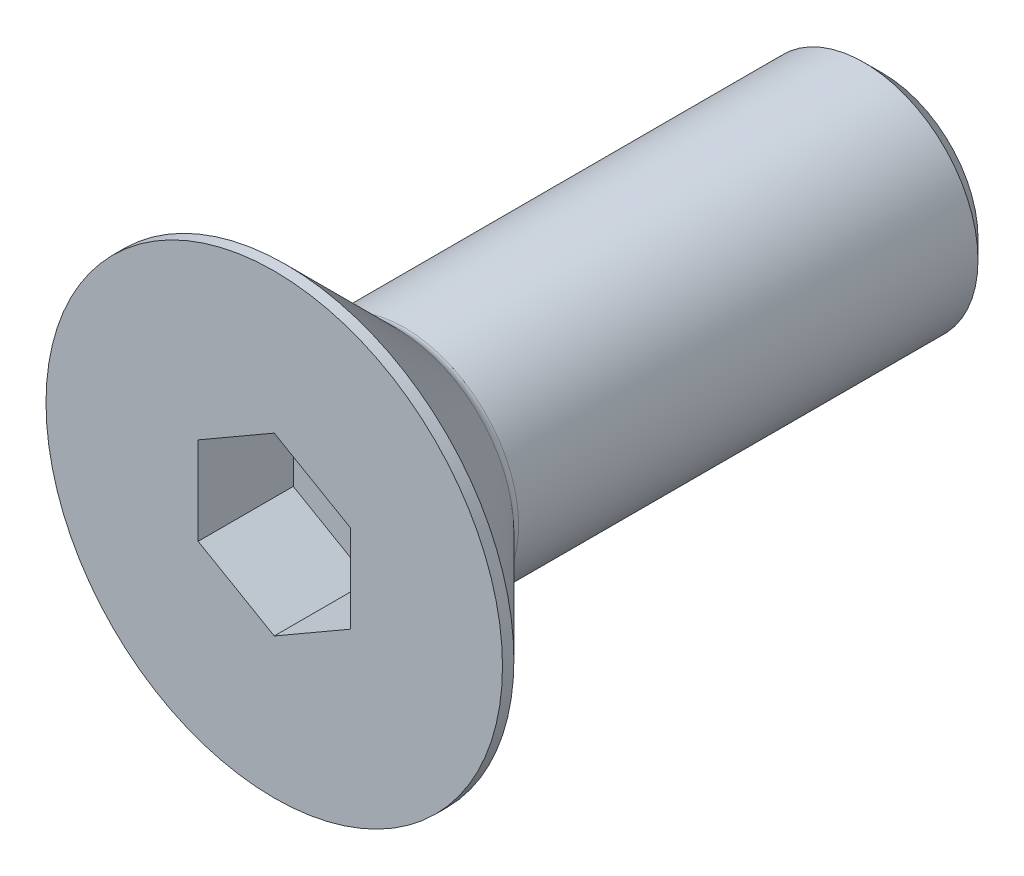
ISO-10303-21;
HEADER;
FILE_DESCRIPTION(('STEP AP214'),'2;1');
FILE_NAME('part.step','',(''),(''),'','','');
FILE_SCHEMA(('AUTOMOTIVE_DESIGN { 1 0 10303 214 1 1 1 1 }'));
ENDSEC;
DATA;
#1=APPLICATION_CONTEXT('core data for automotive mechanical design processes');
#2=APPLICATION_PROTOCOL_DEFINITION('international standard','automotive_design',2000,#1);
#3=PRODUCT_CONTEXT('',#1,'mechanical');
#4=PRODUCT('Part','Part','',(#3));
#5=PRODUCT_RELATED_PRODUCT_CATEGORY('part','',(#4));
#6=PRODUCT_DEFINITION_FORMATION('','',#4);
#7=PRODUCT_DEFINITION_CONTEXT('part definition',#1,'design');
#8=PRODUCT_DEFINITION('design','',#6,#7);
#9=PRODUCT_DEFINITION_SHAPE('','',#8);
#10=(LENGTH_UNIT() NAMED_UNIT(*) SI_UNIT(.MILLI.,.METRE.));
#11=(NAMED_UNIT(*) PLANE_ANGLE_UNIT() SI_UNIT($,.RADIAN.));
#12=(NAMED_UNIT(*) SI_UNIT($,.STERADIAN.) SOLID_ANGLE_UNIT());
#13=UNCERTAINTY_MEASURE_WITH_UNIT(LENGTH_MEASURE(1.E-05),#10,'distance_accuracy_value','');
#14=(GEOMETRIC_REPRESENTATION_CONTEXT(3) GLOBAL_UNCERTAINTY_ASSIGNED_CONTEXT((#13)) GLOBAL_UNIT_ASSIGNED_CONTEXT((#10,
#11,#12)) REPRESENTATION_CONTEXT('',''));
#15=CARTESIAN_POINT('',(0.,0.,0.));
#16=DIRECTION('',(0.,0.,1.));
#17=DIRECTION('',(1.,0.,0.));
#18=AXIS2_PLACEMENT_3D('',#15,#16,#17);
#19=CARTESIAN_POINT('',(0.,0.,-2.5));
#20=DIRECTION('',(0.,0.,1.));
#21=DIRECTION('',(1.,0.,0.));
#22=AXIS2_PLACEMENT_3D('',#19,#20,#21);
#23=PLANE('',#22);
#24=DIRECTION('',(-0.866025403784439,-0.5,0.));
#25=VECTOR('',#24,1.);
#26=CARTESIAN_POINT('',(0.,2.3094010767585,-2.5));
#27=LINE('',#26,#25);
#28=CARTESIAN_POINT('',(0.,2.3094010767585,-2.5));
#29=VERTEX_POINT('',#28);
#30=CARTESIAN_POINT('',(-2.,1.15470053837925,-2.5));
#31=VERTEX_POINT('',#30);
#32=EDGE_CURVE('E82',#29,#31,#27,.T.);
#33=ORIENTED_EDGE('',*,*,#32,.T.);
#34=DIRECTION('',(0.,1.,0.));
#35=VECTOR('',#34,1.);
#36=CARTESIAN_POINT('',(-2.,1.15470053837925,-2.5));
#37=LINE('',#36,#35);
#38=CARTESIAN_POINT('',(-2.,-1.15470053837925,-2.5));
#39=VERTEX_POINT('',#38);
#40=EDGE_CURVE('E66',#31,#39,#37,.F.);
#41=ORIENTED_EDGE('',*,*,#40,.T.);
#42=DIRECTION('',(0.866025403784439,-0.499999999999999,0.));
#43=VECTOR('',#42,1.);
#44=CARTESIAN_POINT('',(-2.,-1.15470053837925,-2.5));
#45=LINE('',#44,#43);
#46=CARTESIAN_POINT('',(0.,-2.3094010767585,-2.5));
#47=VERTEX_POINT('',#46);
#48=EDGE_CURVE('E71',#39,#47,#45,.T.);
#49=ORIENTED_EDGE('',*,*,#48,.T.);
#50=DIRECTION('',(0.866025403784439,0.5,0.));
#51=VECTOR('',#50,1.);
#52=CARTESIAN_POINT('',(0.,-2.3094010767585,-2.5));
#53=LINE('',#52,#51);
#54=CARTESIAN_POINT('',(2.,-1.15470053837925,-2.5));
#55=VERTEX_POINT('',#54);
#56=EDGE_CURVE('E128',#47,#55,#53,.T.);
#57=ORIENTED_EDGE('',*,*,#56,.T.);
#58=DIRECTION('',(0.,1.,0.));
#59=VECTOR('',#58,1.);
#60=CARTESIAN_POINT('',(2.,-1.15470053837925,-2.5));
#61=LINE('',#60,#59);
#62=CARTESIAN_POINT('',(2.,1.15470053837925,-2.5));
#63=VERTEX_POINT('',#62);
#64=EDGE_CURVE('E132',#55,#63,#61,.T.);
#65=ORIENTED_EDGE('',*,*,#64,.T.);
#66=DIRECTION('',(-0.866025403784439,0.499999999999999,0.));
#67=VECTOR('',#66,1.);
#68=CARTESIAN_POINT('',(2.,1.15470053837925,-2.5));
#69=LINE('',#68,#67);
#70=EDGE_CURVE('E137',#63,#29,#69,.T.);
#71=ORIENTED_EDGE('',*,*,#70,.T.);
#72=EDGE_LOOP('',(#33,#41,#49,#57,#65,#71));
#73=FACE_BOUND('',#72,.T.);
#74=ADVANCED_FACE('F15',(#73),#23,.T.);
#75=CARTESIAN_POINT('',(-2.,-1.15470053837925,0.));
#76=DIRECTION('',(-0.499999999999999,-0.866025403784439,0.));
#77=DIRECTION('',(0.866025403784439,-0.499999999999999,0.));
#78=AXIS2_PLACEMENT_3D('',#75,#76,#77);
#79=PLANE('',#78);
#80=DIRECTION('',(0.,0.,1.));
#81=VECTOR('',#80,1.);
#82=CARTESIAN_POINT('',(-2.,-1.15470053837925,0.));
#83=LINE('',#82,#81);
#84=CARTESIAN_POINT('',(-2.,-1.15470053837925,0.));
#85=VERTEX_POINT('',#84);
#86=EDGE_CURVE('E73',#39,#85,#83,.T.);
#87=ORIENTED_EDGE('',*,*,#86,.T.);
#88=DIRECTION('',(-0.866025403784439,0.499999999999999,0.));
#89=VECTOR('',#88,1.);
#90=CARTESIAN_POINT('',(0.,-2.3094010767585,0.));
#91=LINE('',#90,#89);
#92=CARTESIAN_POINT('',(0.,-2.3094010767585,0.));
#93=VERTEX_POINT('',#92);
#94=EDGE_CURVE('E126',#93,#85,#91,.T.);
#95=ORIENTED_EDGE('',*,*,#94,.F.);
#96=DIRECTION('',(0.,0.,1.));
#97=VECTOR('',#96,1.);
#98=CARTESIAN_POINT('',(0.,-2.3094010767585,0.));
#99=LINE('',#98,#97);
#100=EDGE_CURVE('E76',#93,#47,#99,.F.);
#101=ORIENTED_EDGE('',*,*,#100,.T.);
#102=ORIENTED_EDGE('',*,*,#48,.F.);
#103=EDGE_LOOP('',(#87,#95,#101,#102));
#104=FACE_BOUND('',#103,.T.);
#105=ADVANCED_FACE('F72',(#104),#79,.F.);
#106=CARTESIAN_POINT('',(-2.,1.15470053837925,0.));
#107=DIRECTION('',(-1.,0.,0.));
#108=DIRECTION('',(0.,0.,1.));
#109=AXIS2_PLACEMENT_3D('',#106,#107,#108);
#110=PLANE('',#109);
#111=DIRECTION('',(0.,0.,1.));
#112=VECTOR('',#111,1.);
#113=CARTESIAN_POINT('',(-2.,1.15470053837925,0.));
#114=LINE('',#113,#112);
#115=CARTESIAN_POINT('',(-2.,1.15470053837925,0.));
#116=VERTEX_POINT('',#115);
#117=EDGE_CURVE('E84',#31,#116,#114,.T.);
#118=ORIENTED_EDGE('',*,*,#117,.T.);
#119=DIRECTION('',(0.,1.,0.));
#120=VECTOR('',#119,1.);
#121=CARTESIAN_POINT('',(-2.,0.,0.));
#122=LINE('',#121,#120);
#123=EDGE_CURVE('E88',#85,#116,#122,.T.);
#124=ORIENTED_EDGE('',*,*,#123,.F.);
#125=ORIENTED_EDGE('',*,*,#86,.F.);
#126=ORIENTED_EDGE('',*,*,#40,.F.);
#127=EDGE_LOOP('',(#118,#124,#125,#126));
#128=FACE_BOUND('',#127,.T.);
#129=ADVANCED_FACE('F86',(#128),#110,.F.);
#130=CARTESIAN_POINT('',(0.,2.3094010767585,0.));
#131=DIRECTION('',(-0.5,0.866025403784439,0.));
#132=DIRECTION('',(-0.866025403784439,-0.5,0.));
#133=AXIS2_PLACEMENT_3D('',#130,#131,#132);
#134=PLANE('',#133);
#135=DIRECTION('',(0.,0.,1.));
#136=VECTOR('',#135,1.);
#137=CARTESIAN_POINT('',(0.,2.3094010767585,0.));
#138=LINE('',#137,#136);
#139=CARTESIAN_POINT('',(0.,2.3094010767585,0.));
#140=VERTEX_POINT('',#139);
#141=EDGE_CURVE('E139',#29,#140,#138,.T.);
#142=ORIENTED_EDGE('',*,*,#141,.T.);
#143=DIRECTION('',(0.866025403784439,0.5,0.));
#144=VECTOR('',#143,1.);
#145=CARTESIAN_POINT('',(-2.,1.15470053837925,0.));
#146=LINE('',#145,#144);
#147=EDGE_CURVE('E122',#116,#140,#146,.T.);
#148=ORIENTED_EDGE('',*,*,#147,.F.);
#149=ORIENTED_EDGE('',*,*,#117,.F.);
#150=ORIENTED_EDGE('',*,*,#32,.F.);
#151=EDGE_LOOP('',(#142,#148,#149,#150));
#152=FACE_BOUND('',#151,.T.);
#153=ADVANCED_FACE('F143',(#152),#134,.F.);
#154=CARTESIAN_POINT('',(2.,1.15470053837925,0.));
#155=DIRECTION('',(0.499999999999999,0.866025403784439,0.));
#156=DIRECTION('',(-0.866025403784439,0.499999999999999,0.));
#157=AXIS2_PLACEMENT_3D('',#154,#155,#156);
#158=PLANE('',#157);
#159=DIRECTION('',(0.,0.,-1.));
#160=VECTOR('',#159,1.);
#161=CARTESIAN_POINT('',(2.,1.15470053837925,0.));
#162=LINE('',#161,#160);
#163=CARTESIAN_POINT('',(2.,1.15470053837925,0.));
#164=VERTEX_POINT('',#163);
#165=EDGE_CURVE('E135',#63,#164,#162,.F.);
#166=ORIENTED_EDGE('',*,*,#165,.T.);
#167=DIRECTION('',(0.866025403784439,-0.499999999999999,0.));
#168=VECTOR('',#167,1.);
#169=CARTESIAN_POINT('',(0.,2.3094010767585,0.));
#170=LINE('',#169,#168);
#171=EDGE_CURVE('E119',#140,#164,#170,.T.);
#172=ORIENTED_EDGE('',*,*,#171,.F.);
#173=ORIENTED_EDGE('',*,*,#141,.F.);
#174=ORIENTED_EDGE('',*,*,#70,.F.);
#175=EDGE_LOOP('',(#166,#172,#173,#174));
#176=FACE_BOUND('',#175,.T.);
#177=ADVANCED_FACE('F154',(#176),#158,.F.);
#178=CARTESIAN_POINT('',(2.,-1.15470053837925,0.));
#179=DIRECTION('',(1.,0.,0.));
#180=DIRECTION('',(0.,0.,-1.));
#181=AXIS2_PLACEMENT_3D('',#178,#179,#180);
#182=PLANE('',#181);
#183=DIRECTION('',(0.,0.,1.));
#184=VECTOR('',#183,1.);
#185=CARTESIAN_POINT('',(2.,-1.15470053837925,0.));
#186=LINE('',#185,#184);
#187=CARTESIAN_POINT('',(2.,-1.15470053837925,0.));
#188=VERTEX_POINT('',#187);
#189=EDGE_CURVE('E34',#55,#188,#186,.T.);
#190=ORIENTED_EDGE('',*,*,#189,.T.);
#191=DIRECTION('',(0.,1.,0.));
#192=VECTOR('',#191,1.);
#193=CARTESIAN_POINT('',(2.,0.,0.));
#194=LINE('',#193,#192);
#195=EDGE_CURVE('E116',#164,#188,#194,.F.);
#196=ORIENTED_EDGE('',*,*,#195,.F.);
#197=ORIENTED_EDGE('',*,*,#165,.F.);
#198=ORIENTED_EDGE('',*,*,#64,.F.);
#199=EDGE_LOOP('',(#190,#196,#197,#198));
#200=FACE_BOUND('',#199,.T.);
#201=ADVANCED_FACE('F152',(#200),#182,.F.);
#202=CARTESIAN_POINT('',(0.,-2.3094010767585,0.));
#203=DIRECTION('',(0.5,-0.866025403784439,0.));
#204=DIRECTION('',(0.866025403784439,0.5,0.));
#205=AXIS2_PLACEMENT_3D('',#202,#203,#204);
#206=PLANE('',#205);
#207=ORIENTED_EDGE('',*,*,#100,.F.);
#208=DIRECTION('',(-0.866025403784439,-0.5,0.));
#209=VECTOR('',#208,1.);
#210=CARTESIAN_POINT('',(2.,-1.15470053837925,0.));
#211=LINE('',#210,#209);
#212=EDGE_CURVE('E113',#188,#93,#211,.T.);
#213=ORIENTED_EDGE('',*,*,#212,.F.);
#214=ORIENTED_EDGE('',*,*,#189,.F.);
#215=ORIENTED_EDGE('',*,*,#56,.F.);
#216=EDGE_LOOP('',(#207,#213,#214,#215));
#217=FACE_BOUND('',#216,.T.);
#218=ADVANCED_FACE('F150',(#217),#206,.F.);
#219=CARTESIAN_POINT('',(3.,0.,0.));
#220=DIRECTION('',(0.,0.,1.));
#221=DIRECTION('',(1.,0.,0.));
#222=AXIS2_PLACEMENT_3D('',#219,#220,#221);
#223=PLANE('',#222);
#224=ORIENTED_EDGE('',*,*,#195,.T.);
#225=ORIENTED_EDGE('',*,*,#212,.T.);
#226=ORIENTED_EDGE('',*,*,#94,.T.);
#227=ORIENTED_EDGE('',*,*,#123,.T.);
#228=ORIENTED_EDGE('',*,*,#147,.T.);
#229=ORIENTED_EDGE('',*,*,#171,.T.);
#230=EDGE_LOOP('',(#224,#225,#226,#227,#228,#229));
#231=FACE_BOUND('',#230,.T.);
#232=CARTESIAN_POINT('',(0.,0.,0.));
#233=DIRECTION('',(0.,0.,-1.));
#234=DIRECTION('',(-1.,0.,0.));
#235=AXIS2_PLACEMENT_3D('',#232,#233,#234);
#236=CIRCLE('',#235,6.);
#237=CARTESIAN_POINT('',(-6.,0.,0.));
#238=VERTEX_POINT('',#237);
#239=EDGE_CURVE('E19',#238,#238,#236,.T.);
#240=ORIENTED_EDGE('',*,*,#239,.F.);
#241=EDGE_LOOP('',(#240));
#242=FACE_BOUND('',#241,.T.);
#243=ADVANCED_FACE('F147',(#231,#242),#223,.T.);
#244=CARTESIAN_POINT('',(0.,0.,-0.150000000000001));
#245=DIRECTION('',(0.,0.,-1.));
#246=DIRECTION('',(-1.,0.,0.));
#247=AXIS2_PLACEMENT_3D('',#244,#245,#246);
#248=CYLINDRICAL_SURFACE('',#247,6.);
#249=ORIENTED_EDGE('',*,*,#239,.T.);
#250=EDGE_LOOP('',(#249));
#251=FACE_BOUND('',#250,.T.);
#252=CARTESIAN_POINT('',(0.,0.,-0.299999998617295));
#253=DIRECTION('',(0.,0.,1.));
#254=DIRECTION('',(1.,0.,0.));
#255=AXIS2_PLACEMENT_3D('',#252,#253,#254);
#256=CIRCLE('',#255,5.99999999872125);
#257=CARTESIAN_POINT('',(5.99999999872125,0.,-0.299999998617295));
#258=VERTEX_POINT('',#257);
#259=EDGE_CURVE('E100',#258,#258,#256,.F.);
#260=ORIENTED_EDGE('',*,*,#259,.F.);
#261=EDGE_LOOP('',(#260));
#262=FACE_BOUND('',#261,.T.);
#263=ADVANCED_FACE('F183',(#251,#262),#248,.T.);
#264=CARTESIAN_POINT('',(0.,0.,-0.299999998617295));
#265=DIRECTION('',(0.,0.,1.));
#266=DIRECTION('',(1.,0.,0.));
#267=AXIS2_PLACEMENT_3D('',#264,#265,#266);
#268=CONICAL_SURFACE('',#267,5.99999999872125,0.78539816249955);
#269=CARTESIAN_POINT('',(0.,0.,-3.21213203435597));
#270=DIRECTION('',(0.,0.,-1.));
#271=DIRECTION('',(0.,1.,0.));
#272=AXIS2_PLACEMENT_3D('',#269,#270,#271);
#273=CIRCLE('',#272,3.08786796564404);
#274=CARTESIAN_POINT('',(0.,3.08786796564404,-3.21213203435597));
#275=VERTEX_POINT('',#274);
#276=EDGE_CURVE('E94',#275,#275,#273,.T.);
#277=ORIENTED_EDGE('',*,*,#276,.F.);
#278=EDGE_LOOP('',(#277));
#279=FACE_BOUND('',#278,.T.);
#280=ORIENTED_EDGE('',*,*,#259,.T.);
#281=EDGE_LOOP('',(#280));
#282=FACE_BOUND('',#281,.T.);
#283=ADVANCED_FACE('F179',(#279,#282),#268,.T.);
#284=CARTESIAN_POINT('',(1.5,0.,-16.));
#285=DIRECTION('',(0.,0.,-1.));
#286=DIRECTION('',(-1.,0.,0.));
#287=AXIS2_PLACEMENT_3D('',#284,#285,#286);
#288=PLANE('',#287);
#289=CARTESIAN_POINT('',(0.,0.,-16.0000000002469));
#290=DIRECTION('',(0.,0.,1.));
#291=DIRECTION('',(1.,0.,0.));
#292=AXIS2_PLACEMENT_3D('',#289,#290,#291);
#293=CIRCLE('',#292,2.5000000002251);
#294=CARTESIAN_POINT('',(2.5000000002251,0.,-16.0000000002469));
#295=VERTEX_POINT('',#294);
#296=EDGE_CURVE('E92',#295,#295,#293,.T.);
#297=ORIENTED_EDGE('',*,*,#296,.F.);
#298=EDGE_LOOP('',(#297));
#299=FACE_BOUND('',#298,.T.);
#300=ADVANCED_FACE('F176',(#299),#288,.T.);
#301=CARTESIAN_POINT('',(0.,0.,-3.42426406871193));
#302=DIRECTION('',(0.,0.,-1.));
#303=DIRECTION('',(0.,1.,0.));
#304=AXIS2_PLACEMENT_3D('',#301,#302,#303);
#305=TOROIDAL_SURFACE('',#304,3.3,0.3);
#306=CARTESIAN_POINT('',(0.,0.,-3.42426406871193));
#307=DIRECTION('',(0.,0.,-1.));
#308=DIRECTION('',(-1.,0.,0.));
#309=AXIS2_PLACEMENT_3D('',#306,#307,#308);
#310=CIRCLE('',#309,3.);
#311=CARTESIAN_POINT('',(-3.,0.,-3.42426406871193));
#312=VERTEX_POINT('',#311);
#313=EDGE_CURVE('E25',#312,#312,#310,.T.);
#314=ORIENTED_EDGE('',*,*,#313,.F.);
#315=EDGE_LOOP('',(#314));
#316=FACE_BOUND('',#315,.T.);
#317=ORIENTED_EDGE('',*,*,#276,.T.);
#318=EDGE_LOOP('',(#317));
#319=FACE_BOUND('',#318,.T.);
#320=ADVANCED_FACE('F17',(#316,#319),#305,.F.);
#321=CARTESIAN_POINT('',(0.,0.,-15.499999999804));
#322=DIRECTION('',(0.,0.,1.));
#323=DIRECTION('',(1.,0.,0.));
#324=AXIS2_PLACEMENT_3D('',#321,#322,#323);
#325=CONICAL_SURFACE('',#324,2.99999999975853,0.785398162487954);
#326=ORIENTED_EDGE('',*,*,#296,.T.);
#327=EDGE_LOOP('',(#326));
#328=FACE_BOUND('',#327,.T.);
#329=CARTESIAN_POINT('',(0.,0.,-15.5));
#330=DIRECTION('',(0.,0.,-1.));
#331=DIRECTION('',(-1.,0.,0.));
#332=AXIS2_PLACEMENT_3D('',#329,#330,#331);
#333=CIRCLE('',#332,3.);
#334=CARTESIAN_POINT('',(-3.,0.,-15.5));
#335=VERTEX_POINT('',#334);
#336=EDGE_CURVE('E10',#335,#335,#333,.F.);
#337=ORIENTED_EDGE('',*,*,#336,.F.);
#338=EDGE_LOOP('',(#337));
#339=FACE_BOUND('',#338,.T.);
#340=ADVANCED_FACE('F166',(#328,#339),#325,.T.);
#341=CARTESIAN_POINT('',(0.,0.,-9.65));
#342=DIRECTION('',(0.,0.,-1.));
#343=DIRECTION('',(-1.,0.,0.));
#344=AXIS2_PLACEMENT_3D('',#341,#342,#343);
#345=CYLINDRICAL_SURFACE('',#344,3.);
#346=ORIENTED_EDGE('',*,*,#336,.T.);
#347=EDGE_LOOP('',(#346));
#348=FACE_BOUND('',#347,.T.);
#349=ORIENTED_EDGE('',*,*,#313,.T.);
#350=EDGE_LOOP('',(#349));
#351=FACE_BOUND('',#350,.T.);
#352=ADVANCED_FACE('F164',(#348,#351),#345,.T.);
#353=CLOSED_SHELL('',(#74,#105,#129,#153,#177,#201,#218,#243,#263,#283,#300,#320,#340,#352));
#354=MANIFOLD_SOLID_BREP('B1',#353);
#355=ADVANCED_BREP_SHAPE_REPRESENTATION('',(#18,#354),#14);
#356=SHAPE_DEFINITION_REPRESENTATION(#9,#355);
ENDSEC;
END-ISO-10303-21;
